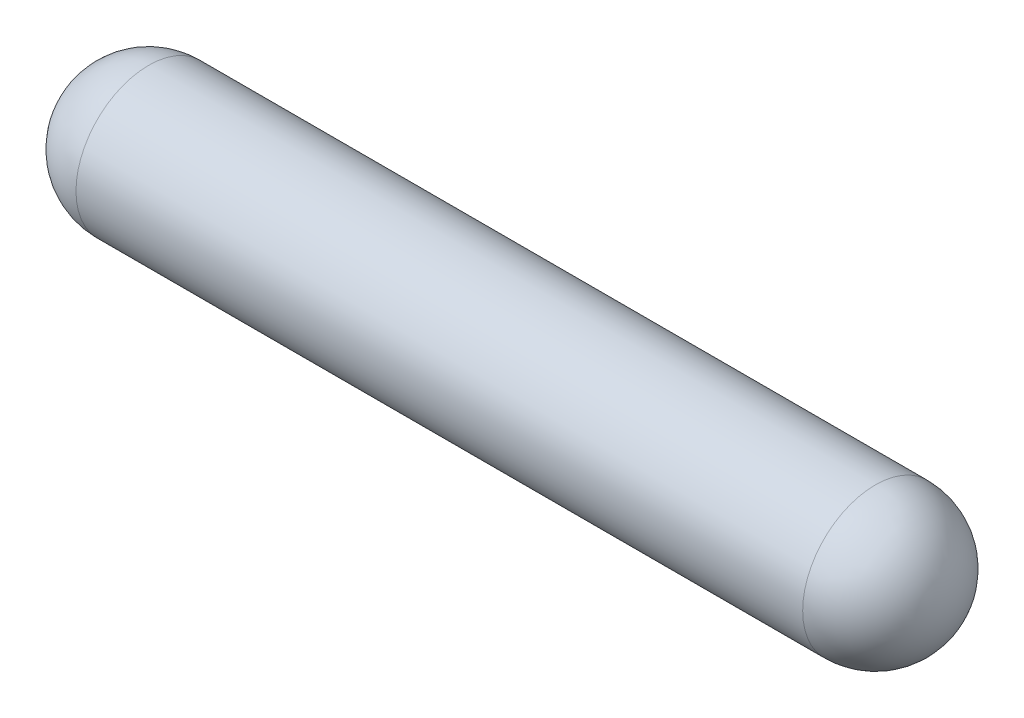
ISO-10303-21;
HEADER;
FILE_DESCRIPTION(('STEP AP214'),'2;1');
FILE_NAME('part.step','',(''),(''),'','','');
FILE_SCHEMA(('AUTOMOTIVE_DESIGN { 1 0 10303 214 1 1 1 1 }'));
ENDSEC;
DATA;
#1=APPLICATION_CONTEXT('core data for automotive mechanical design processes');
#2=APPLICATION_PROTOCOL_DEFINITION('international standard','automotive_design',2000,#1);
#3=PRODUCT_CONTEXT('',#1,'mechanical');
#4=PRODUCT('Part','Part','',(#3));
#5=PRODUCT_RELATED_PRODUCT_CATEGORY('part','',(#4));
#6=PRODUCT_DEFINITION_FORMATION('','',#4);
#7=PRODUCT_DEFINITION_CONTEXT('part definition',#1,'design');
#8=PRODUCT_DEFINITION('design','',#6,#7);
#9=PRODUCT_DEFINITION_SHAPE('','',#8);
#10=(LENGTH_UNIT() NAMED_UNIT(*) SI_UNIT(.MILLI.,.METRE.));
#11=(NAMED_UNIT(*) PLANE_ANGLE_UNIT() SI_UNIT($,.RADIAN.));
#12=(NAMED_UNIT(*) SI_UNIT($,.STERADIAN.) SOLID_ANGLE_UNIT());
#13=UNCERTAINTY_MEASURE_WITH_UNIT(LENGTH_MEASURE(1.E-05),#10,'distance_accuracy_value','');
#14=(GEOMETRIC_REPRESENTATION_CONTEXT(3) GLOBAL_UNCERTAINTY_ASSIGNED_CONTEXT((#13)) GLOBAL_UNIT_ASSIGNED_CONTEXT((#10,
#11,#12)) REPRESENTATION_CONTEXT('',''));
#15=CARTESIAN_POINT('',(0.,0.,0.));
#16=DIRECTION('',(0.,0.,1.));
#17=DIRECTION('',(1.,0.,0.));
#18=AXIS2_PLACEMENT_3D('',#15,#16,#17);
#19=CARTESIAN_POINT('',(-0.750000000000002,0.,0.));
#20=DIRECTION('',(-1.,0.,0.));
#21=DIRECTION('',(0.,1.,0.));
#22=AXIS2_PLACEMENT_3D('',#19,#20,#21);
#23=SPHERICAL_SURFACE('',#22,0.750000000000002);
#24=CARTESIAN_POINT('',(-0.750000000000002,0.,0.));
#25=DIRECTION('',(-1.,0.,0.));
#26=DIRECTION('',(0.,0.,1.));
#27=AXIS2_PLACEMENT_3D('',#24,#25,#26);
#28=CIRCLE('',#27,0.750000000000002);
#29=CARTESIAN_POINT('',(-0.750000000000002,0.,0.750000000000002));
#30=VERTEX_POINT('',#29);
#31=EDGE_CURVE('E35',#30,#30,#28,.T.);
#32=ORIENTED_EDGE('',*,*,#31,.F.);
#33=EDGE_LOOP('',(#32));
#34=FACE_BOUND('',#33,.T.);
#35=ADVANCED_FACE('F29',(#34),#23,.T.);
#36=CARTESIAN_POINT('',(-8.24999999999999,0.,0.));
#37=DIRECTION('',(-1.,0.,0.));
#38=DIRECTION('',(0.,1.,0.));
#39=AXIS2_PLACEMENT_3D('',#36,#37,#38);
#40=SPHERICAL_SURFACE('',#39,0.750000000000002);
#41=CARTESIAN_POINT('',(-8.24999999999999,0.,0.));
#42=DIRECTION('',(-1.,0.,0.));
#43=DIRECTION('',(0.,0.,1.));
#44=AXIS2_PLACEMENT_3D('',#41,#42,#43);
#45=CIRCLE('',#44,0.750000000000001);
#46=CARTESIAN_POINT('',(-8.24999999999999,0.,0.750000000000001));
#47=VERTEX_POINT('',#46);
#48=EDGE_CURVE('E10',#47,#47,#45,.T.);
#49=ORIENTED_EDGE('',*,*,#48,.T.);
#50=EDGE_LOOP('',(#49));
#51=FACE_BOUND('',#50,.T.);
#52=ADVANCED_FACE('F44',(#51),#40,.T.);
#53=CARTESIAN_POINT('',(0.,0.,0.));
#54=DIRECTION('',(-1.,0.,0.));
#55=DIRECTION('',(0.,0.,1.));
#56=AXIS2_PLACEMENT_3D('',#53,#54,#55);
#57=CYLINDRICAL_SURFACE('',#56,0.750000000000002);
#58=ORIENTED_EDGE('',*,*,#48,.F.);
#59=EDGE_LOOP('',(#58));
#60=FACE_BOUND('',#59,.T.);
#61=ORIENTED_EDGE('',*,*,#31,.T.);
#62=EDGE_LOOP('',(#61));
#63=FACE_BOUND('',#62,.T.);
#64=ADVANCED_FACE('F41',(#60,#63),#57,.T.);
#65=CLOSED_SHELL('',(#35,#52,#64));
#66=MANIFOLD_SOLID_BREP('B2',#65);
#67=ADVANCED_BREP_SHAPE_REPRESENTATION('',(#18,#66),#14);
#68=SHAPE_DEFINITION_REPRESENTATION(#9,#67);
ENDSEC;
END-ISO-10303-21;
